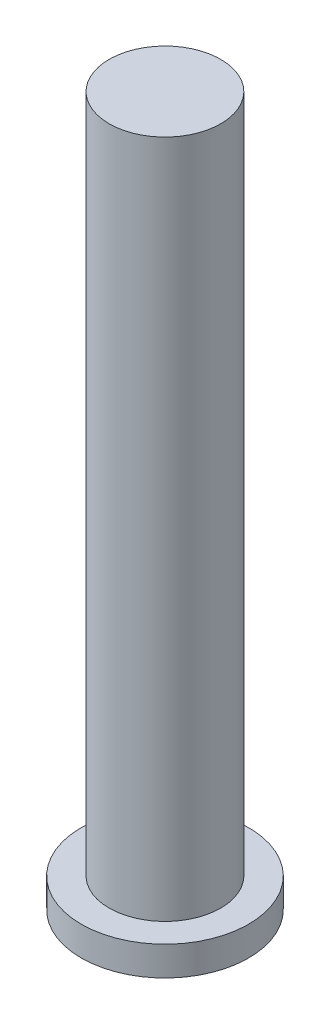
ISO-10303-21;
HEADER;
FILE_DESCRIPTION(('STEP AP214'),'2;1');
FILE_NAME('part.step','',(''),(''),'','','');
FILE_SCHEMA(('AUTOMOTIVE_DESIGN { 1 0 10303 214 1 1 1 1 }'));
ENDSEC;
DATA;
#1=APPLICATION_CONTEXT('core data for automotive mechanical design processes');
#2=APPLICATION_PROTOCOL_DEFINITION('international standard','automotive_design',2000,#1);
#3=PRODUCT_CONTEXT('',#1,'mechanical');
#4=PRODUCT('Part','Part','',(#3));
#5=PRODUCT_RELATED_PRODUCT_CATEGORY('part','',(#4));
#6=PRODUCT_DEFINITION_FORMATION('','',#4);
#7=PRODUCT_DEFINITION_CONTEXT('part definition',#1,'design');
#8=PRODUCT_DEFINITION('design','',#6,#7);
#9=PRODUCT_DEFINITION_SHAPE('','',#8);
#10=(LENGTH_UNIT() NAMED_UNIT(*) SI_UNIT(.MILLI.,.METRE.));
#11=(NAMED_UNIT(*) PLANE_ANGLE_UNIT() SI_UNIT($,.RADIAN.));
#12=(NAMED_UNIT(*) SI_UNIT($,.STERADIAN.) SOLID_ANGLE_UNIT());
#13=UNCERTAINTY_MEASURE_WITH_UNIT(LENGTH_MEASURE(1.E-05),#10,'distance_accuracy_value','');
#14=(GEOMETRIC_REPRESENTATION_CONTEXT(3) GLOBAL_UNCERTAINTY_ASSIGNED_CONTEXT((#13)) GLOBAL_UNIT_ASSIGNED_CONTEXT((#10,
#11,#12)) REPRESENTATION_CONTEXT('',''));
#15=CARTESIAN_POINT('',(0.,0.,0.));
#16=DIRECTION('',(0.,0.,1.));
#17=DIRECTION('',(1.,0.,0.));
#18=AXIS2_PLACEMENT_3D('',#15,#16,#17);
#19=CARTESIAN_POINT('',(0.,0.525,0.));
#20=DIRECTION('',(0.,-1.,0.));
#21=DIRECTION('',(0.,0.,-1.));
#22=AXIS2_PLACEMENT_3D('',#19,#20,#21);
#23=CYLINDRICAL_SURFACE('',#22,1.5);
#24=CARTESIAN_POINT('',(0.,0.525,0.));
#25=DIRECTION('',(0.,1.,0.));
#26=DIRECTION('',(0.,0.,1.));
#27=AXIS2_PLACEMENT_3D('',#24,#25,#26);
#28=CIRCLE('',#27,1.5);
#29=CARTESIAN_POINT('',(0.,0.525,1.5));
#30=VERTEX_POINT('',#29);
#31=EDGE_CURVE('E49',#30,#30,#28,.T.);
#32=ORIENTED_EDGE('',*,*,#31,.F.);
#33=EDGE_LOOP('',(#32));
#34=FACE_BOUND('',#33,.T.);
#35=CARTESIAN_POINT('',(0.,0.,0.));
#36=DIRECTION('',(0.,1.,0.));
#37=DIRECTION('',(0.,0.,1.));
#38=AXIS2_PLACEMENT_3D('',#35,#36,#37);
#39=CIRCLE('',#38,1.5);
#40=CARTESIAN_POINT('',(0.,0.,1.5));
#41=VERTEX_POINT('',#40);
#42=EDGE_CURVE('E44',#41,#41,#39,.T.);
#43=ORIENTED_EDGE('',*,*,#42,.T.);
#44=EDGE_LOOP('',(#43));
#45=FACE_BOUND('',#44,.T.);
#46=ADVANCED_FACE('F41',(#34,#45),#23,.T.);
#47=CARTESIAN_POINT('',(0.,0.525,0.));
#48=DIRECTION('',(0.,1.,0.));
#49=DIRECTION('',(0.,0.,1.));
#50=AXIS2_PLACEMENT_3D('',#47,#48,#49);
#51=PLANE('',#50);
#52=CARTESIAN_POINT('',(0.,0.525,0.));
#53=DIRECTION('',(0.,1.,0.));
#54=DIRECTION('',(0.,0.,1.));
#55=AXIS2_PLACEMENT_3D('',#52,#53,#54);
#56=CIRCLE('',#55,1.);
#57=CARTESIAN_POINT('',(0.,0.525,1.));
#58=VERTEX_POINT('',#57);
#59=EDGE_CURVE('E10',#58,#58,#56,.T.);
#60=ORIENTED_EDGE('',*,*,#59,.F.);
#61=EDGE_LOOP('',(#60));
#62=FACE_BOUND('',#61,.T.);
#63=ORIENTED_EDGE('',*,*,#31,.T.);
#64=EDGE_LOOP('',(#63));
#65=FACE_BOUND('',#64,.T.);
#66=ADVANCED_FACE('F69',(#62,#65),#51,.T.);
#67=CARTESIAN_POINT('',(0.,0.,0.));
#68=DIRECTION('',(0.,1.,0.));
#69=DIRECTION('',(0.,0.,1.));
#70=AXIS2_PLACEMENT_3D('',#67,#68,#69);
#71=PLANE('',#70);
#72=ORIENTED_EDGE('',*,*,#42,.F.);
#73=EDGE_LOOP('',(#72));
#74=FACE_BOUND('',#73,.T.);
#75=ADVANCED_FACE('F66',(#74),#71,.F.);
#76=CARTESIAN_POINT('',(0.,12.7,0.));
#77=DIRECTION('',(0.,-1.,0.));
#78=DIRECTION('',(0.,0.,-1.));
#79=AXIS2_PLACEMENT_3D('',#76,#77,#78);
#80=CYLINDRICAL_SURFACE('',#79,1.);
#81=CARTESIAN_POINT('',(0.,12.7,0.));
#82=DIRECTION('',(0.,1.,0.));
#83=DIRECTION('',(0.,0.,1.));
#84=AXIS2_PLACEMENT_3D('',#81,#82,#83);
#85=CIRCLE('',#84,1.);
#86=CARTESIAN_POINT('',(0.,12.7,1.));
#87=VERTEX_POINT('',#86);
#88=EDGE_CURVE('E56',#87,#87,#85,.T.);
#89=ORIENTED_EDGE('',*,*,#88,.F.);
#90=EDGE_LOOP('',(#89));
#91=FACE_BOUND('',#90,.T.);
#92=ORIENTED_EDGE('',*,*,#59,.T.);
#93=EDGE_LOOP('',(#92));
#94=FACE_BOUND('',#93,.T.);
#95=ADVANCED_FACE('F68',(#91,#94),#80,.T.);
#96=CARTESIAN_POINT('',(0.,12.7,0.));
#97=DIRECTION('',(0.,1.,0.));
#98=DIRECTION('',(0.,0.,1.));
#99=AXIS2_PLACEMENT_3D('',#96,#97,#98);
#100=PLANE('',#99);
#101=ORIENTED_EDGE('',*,*,#88,.T.);
#102=EDGE_LOOP('',(#101));
#103=FACE_BOUND('',#102,.T.);
#104=ADVANCED_FACE('F74',(#103),#100,.T.);
#105=CLOSED_SHELL('',(#46,#66,#75,#95,#104));
#106=MANIFOLD_SOLID_BREP('B2',#105);
#107=ADVANCED_BREP_SHAPE_REPRESENTATION('',(#18,#106),#14);
#108=SHAPE_DEFINITION_REPRESENTATION(#9,#107);
ENDSEC;
END-ISO-10303-21;
